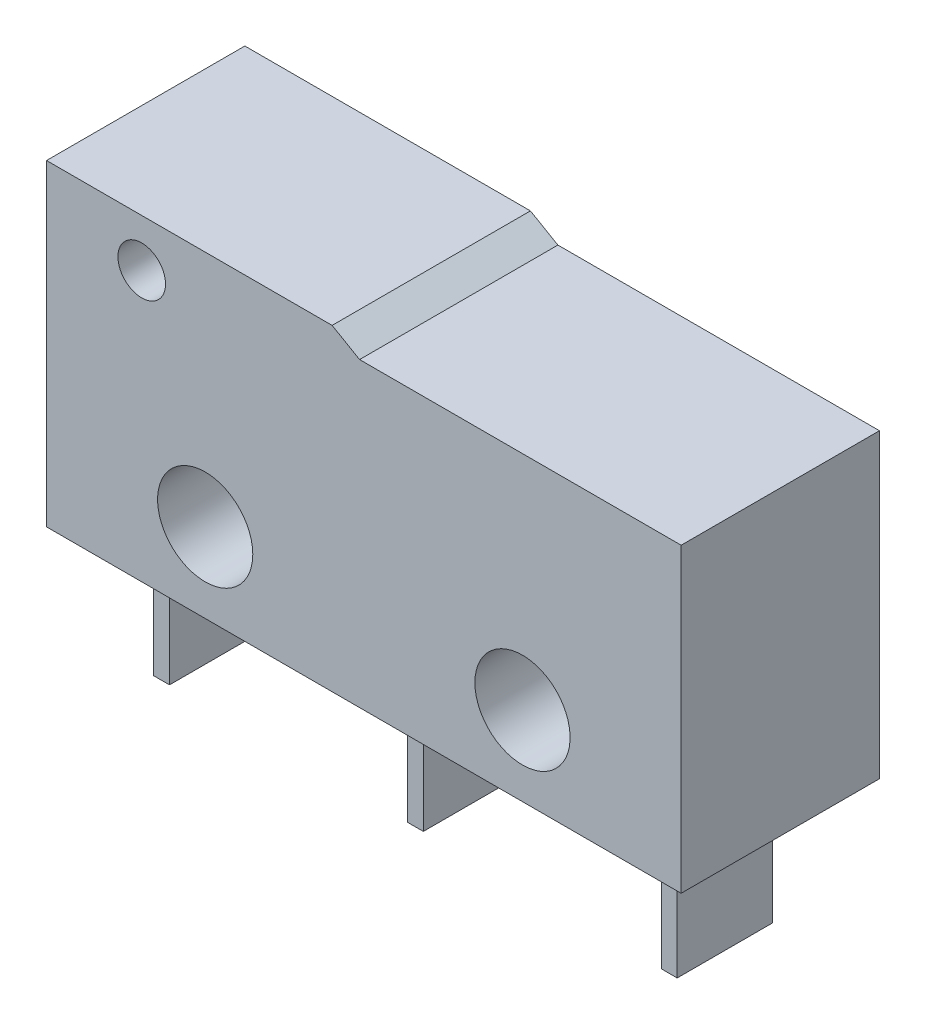
ISO-10303-21;
HEADER;
FILE_DESCRIPTION(('STEP AP214'),'2;1');
FILE_NAME('part.step','',(''),(''),'','','');
FILE_SCHEMA(('AUTOMOTIVE_DESIGN { 1 0 10303 214 1 1 1 1 }'));
ENDSEC;
DATA;
#1=APPLICATION_CONTEXT('core data for automotive mechanical design processes');
#2=APPLICATION_PROTOCOL_DEFINITION('international standard','automotive_design',2000,#1);
#3=PRODUCT_CONTEXT('',#1,'mechanical');
#4=PRODUCT('Part','Part','',(#3));
#5=PRODUCT_RELATED_PRODUCT_CATEGORY('part','',(#4));
#6=PRODUCT_DEFINITION_FORMATION('','',#4);
#7=PRODUCT_DEFINITION_CONTEXT('part definition',#1,'design');
#8=PRODUCT_DEFINITION('design','',#6,#7);
#9=PRODUCT_DEFINITION_SHAPE('','',#8);
#10=(LENGTH_UNIT() NAMED_UNIT(*) SI_UNIT(.MILLI.,.METRE.));
#11=(NAMED_UNIT(*) PLANE_ANGLE_UNIT() SI_UNIT($,.RADIAN.));
#12=(NAMED_UNIT(*) SI_UNIT($,.STERADIAN.) SOLID_ANGLE_UNIT());
#13=UNCERTAINTY_MEASURE_WITH_UNIT(LENGTH_MEASURE(1.E-05),#10,'distance_accuracy_value','');
#14=(GEOMETRIC_REPRESENTATION_CONTEXT(3) GLOBAL_UNCERTAINTY_ASSIGNED_CONTEXT((#13)) GLOBAL_UNIT_ASSIGNED_CONTEXT((#10,
#11,#12)) REPRESENTATION_CONTEXT('',''));
#15=CARTESIAN_POINT('',(0.,0.,0.));
#16=DIRECTION('',(0.,0.,1.));
#17=DIRECTION('',(1.,0.,0.));
#18=AXIS2_PLACEMENT_3D('',#15,#16,#17);
#19=CARTESIAN_POINT('',(10.,0.,3.125));
#20=DIRECTION('',(0.,1.,0.));
#21=DIRECTION('',(0.,0.,1.));
#22=AXIS2_PLACEMENT_3D('',#19,#20,#21);
#23=PLANE('',#22);
#24=DIRECTION('',(0.,0.,-1.));
#25=VECTOR('',#24,1.);
#26=CARTESIAN_POINT('',(-8.25,0.,-1.5));
#27=LINE('',#26,#25);
#28=CARTESIAN_POINT('',(-8.25,0.,1.5));
#29=VERTEX_POINT('',#28);
#30=CARTESIAN_POINT('',(-8.25,0.,-1.5));
#31=VERTEX_POINT('',#30);
#32=EDGE_CURVE('E179',#29,#31,#27,.T.);
#33=ORIENTED_EDGE('',*,*,#32,.F.);
#34=DIRECTION('',(-1.,0.,0.));
#35=VECTOR('',#34,1.);
#36=CARTESIAN_POINT('',(-7.75,0.,1.5));
#37=LINE('',#36,#35);
#38=CARTESIAN_POINT('',(-7.75,0.,1.5));
#39=VERTEX_POINT('',#38);
#40=EDGE_CURVE('E192',#39,#29,#37,.T.);
#41=ORIENTED_EDGE('',*,*,#40,.F.);
#42=DIRECTION('',(0.,0.,1.));
#43=VECTOR('',#42,1.);
#44=CARTESIAN_POINT('',(-7.75,0.,-1.5));
#45=LINE('',#44,#43);
#46=CARTESIAN_POINT('',(-7.75,0.,-1.5));
#47=VERTEX_POINT('',#46);
#48=EDGE_CURVE('E201',#47,#39,#45,.T.);
#49=ORIENTED_EDGE('',*,*,#48,.F.);
#50=DIRECTION('',(1.,0.,0.));
#51=VECTOR('',#50,1.);
#52=CARTESIAN_POINT('',(-7.75,0.,-1.5));
#53=LINE('',#52,#51);
#54=EDGE_CURVE('E182',#31,#47,#53,.T.);
#55=ORIENTED_EDGE('',*,*,#54,.F.);
#56=EDGE_LOOP('',(#33,#41,#49,#55));
#57=FACE_BOUND('',#56,.T.);
#58=DIRECTION('',(1.,0.,0.));
#59=VECTOR('',#58,1.);
#60=CARTESIAN_POINT('',(10.,0.,-3.125));
#61=LINE('',#60,#59);
#62=CARTESIAN_POINT('',(-10.,0.,-3.125));
#63=VERTEX_POINT('',#62);
#64=CARTESIAN_POINT('',(10.,0.,-3.125));
#65=VERTEX_POINT('',#64);
#66=EDGE_CURVE('E288',#63,#65,#61,.T.);
#67=ORIENTED_EDGE('',*,*,#66,.T.);
#68=DIRECTION('',(0.,0.,-1.));
#69=VECTOR('',#68,1.);
#70=CARTESIAN_POINT('',(10.,0.,3.125));
#71=LINE('',#70,#69);
#72=CARTESIAN_POINT('',(10.,0.,3.125));
#73=VERTEX_POINT('',#72);
#74=EDGE_CURVE('E303',#73,#65,#71,.T.);
#75=ORIENTED_EDGE('',*,*,#74,.F.);
#76=DIRECTION('',(1.,0.,0.));
#77=VECTOR('',#76,1.);
#78=CARTESIAN_POINT('',(10.,0.,3.125));
#79=LINE('',#78,#77);
#80=CARTESIAN_POINT('',(-10.,0.,3.125));
#81=VERTEX_POINT('',#80);
#82=EDGE_CURVE('E275',#81,#73,#79,.T.);
#83=ORIENTED_EDGE('',*,*,#82,.F.);
#84=DIRECTION('',(0.,0.,-1.));
#85=VECTOR('',#84,1.);
#86=CARTESIAN_POINT('',(-10.,0.,3.125));
#87=LINE('',#86,#85);
#88=EDGE_CURVE('E41',#81,#63,#87,.T.);
#89=ORIENTED_EDGE('',*,*,#88,.T.);
#90=EDGE_LOOP('',(#67,#75,#83,#89));
#91=FACE_BOUND('',#90,.T.);
#92=DIRECTION('',(0.,0.,-1.));
#93=VECTOR('',#92,1.);
#94=CARTESIAN_POINT('',(-0.25,0.,-1.5));
#95=LINE('',#94,#93);
#96=CARTESIAN_POINT('',(-0.25,0.,1.5));
#97=VERTEX_POINT('',#96);
#98=CARTESIAN_POINT('',(-0.25,0.,-1.5));
#99=VERTEX_POINT('',#98);
#100=EDGE_CURVE('E217',#97,#99,#95,.T.);
#101=ORIENTED_EDGE('',*,*,#100,.F.);
#102=DIRECTION('',(-1.,0.,0.));
#103=VECTOR('',#102,1.);
#104=CARTESIAN_POINT('',(0.25,0.,1.5));
#105=LINE('',#104,#103);
#106=CARTESIAN_POINT('',(0.25,0.,1.5));
#107=VERTEX_POINT('',#106);
#108=EDGE_CURVE('E222',#107,#97,#105,.T.);
#109=ORIENTED_EDGE('',*,*,#108,.F.);
#110=DIRECTION('',(0.,0.,1.));
#111=VECTOR('',#110,1.);
#112=CARTESIAN_POINT('',(0.25,0.,-1.5));
#113=LINE('',#112,#111);
#114=CARTESIAN_POINT('',(0.25,0.,-1.5));
#115=VERTEX_POINT('',#114);
#116=EDGE_CURVE('E234',#115,#107,#113,.T.);
#117=ORIENTED_EDGE('',*,*,#116,.F.);
#118=DIRECTION('',(1.,0.,0.));
#119=VECTOR('',#118,1.);
#120=CARTESIAN_POINT('',(0.25,0.,-1.5));
#121=LINE('',#120,#119);
#122=EDGE_CURVE('E231',#99,#115,#121,.T.);
#123=ORIENTED_EDGE('',*,*,#122,.F.);
#124=EDGE_LOOP('',(#101,#109,#117,#123));
#125=FACE_BOUND('',#124,.T.);
#126=DIRECTION('',(0.,0.,-1.));
#127=VECTOR('',#126,1.);
#128=CARTESIAN_POINT('',(7.75,0.,-1.5));
#129=LINE('',#128,#127);
#130=CARTESIAN_POINT('',(7.75,0.,1.5));
#131=VERTEX_POINT('',#130);
#132=CARTESIAN_POINT('',(7.75,0.,-1.5));
#133=VERTEX_POINT('',#132);
#134=EDGE_CURVE('E178',#131,#133,#129,.T.);
#135=ORIENTED_EDGE('',*,*,#134,.F.);
#136=DIRECTION('',(-1.,0.,0.));
#137=VECTOR('',#136,1.);
#138=CARTESIAN_POINT('',(7.75,0.,1.5));
#139=LINE('',#138,#137);
#140=CARTESIAN_POINT('',(8.25,0.,1.5));
#141=VERTEX_POINT('',#140);
#142=EDGE_CURVE('E175',#141,#131,#139,.T.);
#143=ORIENTED_EDGE('',*,*,#142,.F.);
#144=DIRECTION('',(0.,0.,1.));
#145=VECTOR('',#144,1.);
#146=CARTESIAN_POINT('',(8.25,0.,-1.5));
#147=LINE('',#146,#145);
#148=CARTESIAN_POINT('',(8.25,0.,-1.5));
#149=VERTEX_POINT('',#148);
#150=EDGE_CURVE('E53',#149,#141,#147,.T.);
#151=ORIENTED_EDGE('',*,*,#150,.F.);
#152=DIRECTION('',(1.,0.,0.));
#153=VECTOR('',#152,1.);
#154=CARTESIAN_POINT('',(7.75,0.,-1.5));
#155=LINE('',#154,#153);
#156=EDGE_CURVE('E48',#133,#149,#155,.T.);
#157=ORIENTED_EDGE('',*,*,#156,.F.);
#158=EDGE_LOOP('',(#135,#143,#151,#157));
#159=FACE_BOUND('',#158,.T.);
#160=ADVANCED_FACE('F33',(#57,#91,#125,#159),#23,.F.);
#161=CARTESIAN_POINT('',(0.,0.,3.125));
#162=DIRECTION('',(0.,0.,-1.));
#163=DIRECTION('',(-1.,0.,0.));
#164=AXIS2_PLACEMENT_3D('',#161,#162,#163);
#165=PLANE('',#164);
#166=DIRECTION('',(-1.,0.,0.));
#167=VECTOR('',#166,1.);
#168=CARTESIAN_POINT('',(-10.,10.,3.125));
#169=LINE('',#168,#167);
#170=CARTESIAN_POINT('',(-1.,10.,3.125));
#171=VERTEX_POINT('',#170);
#172=CARTESIAN_POINT('',(-10.,10.,3.125));
#173=VERTEX_POINT('',#172);
#174=EDGE_CURVE('E269',#171,#173,#169,.T.);
#175=ORIENTED_EDGE('',*,*,#174,.T.);
#176=DIRECTION('',(0.,-1.,0.));
#177=VECTOR('',#176,1.);
#178=CARTESIAN_POINT('',(-10.,0.,3.125));
#179=LINE('',#178,#177);
#180=EDGE_CURVE('E272',#173,#81,#179,.T.);
#181=ORIENTED_EDGE('',*,*,#180,.T.);
#182=ORIENTED_EDGE('',*,*,#82,.T.);
#183=DIRECTION('',(0.,1.,0.));
#184=VECTOR('',#183,1.);
#185=CARTESIAN_POINT('',(10.,9.5,3.125));
#186=LINE('',#185,#184);
#187=CARTESIAN_POINT('',(10.,9.5,3.125));
#188=VERTEX_POINT('',#187);
#189=EDGE_CURVE('E277',#73,#188,#186,.T.);
#190=ORIENTED_EDGE('',*,*,#189,.T.);
#191=DIRECTION('',(-1.,0.,0.));
#192=VECTOR('',#191,1.);
#193=CARTESIAN_POINT('',(-0.133974596215564,9.5,3.125));
#194=LINE('',#193,#192);
#195=CARTESIAN_POINT('',(-0.133974596215564,9.5,3.125));
#196=VERTEX_POINT('',#195);
#197=EDGE_CURVE('E279',#188,#196,#194,.T.);
#198=ORIENTED_EDGE('',*,*,#197,.T.);
#199=DIRECTION('',(-0.866025403784438,0.500000000000001,0.));
#200=VECTOR('',#199,1.);
#201=CARTESIAN_POINT('',(-1.,10.,3.125));
#202=LINE('',#201,#200);
#203=EDGE_CURVE('E281',#196,#171,#202,.T.);
#204=ORIENTED_EDGE('',*,*,#203,.T.);
#205=EDGE_LOOP('',(#175,#181,#182,#190,#198,#204));
#206=FACE_BOUND('',#205,.T.);
#207=CARTESIAN_POINT('',(-5.,2.5,3.125));
#208=DIRECTION('',(0.,0.,1.));
#209=DIRECTION('',(1.,0.,0.));
#210=AXIS2_PLACEMENT_3D('',#207,#208,#209);
#211=CIRCLE('',#210,1.5);
#212=CARTESIAN_POINT('',(-3.5,2.5,3.125));
#213=VERTEX_POINT('',#212);
#214=EDGE_CURVE('E263',#213,#213,#211,.T.);
#215=ORIENTED_EDGE('',*,*,#214,.F.);
#216=EDGE_LOOP('',(#215));
#217=FACE_BOUND('',#216,.T.);
#218=CARTESIAN_POINT('',(5.,2.5,3.125));
#219=DIRECTION('',(0.,0.,1.));
#220=DIRECTION('',(-1.,0.,0.));
#221=AXIS2_PLACEMENT_3D('',#218,#219,#220);
#222=CIRCLE('',#221,1.5);
#223=CARTESIAN_POINT('',(3.5,2.5,3.125));
#224=VERTEX_POINT('',#223);
#225=EDGE_CURVE('E257',#224,#224,#222,.T.);
#226=ORIENTED_EDGE('',*,*,#225,.F.);
#227=EDGE_LOOP('',(#226));
#228=FACE_BOUND('',#227,.T.);
#229=CARTESIAN_POINT('',(-7.,8.5,3.125));
#230=DIRECTION('',(0.,0.,1.));
#231=DIRECTION('',(1.,0.,0.));
#232=AXIS2_PLACEMENT_3D('',#229,#230,#231);
#233=CIRCLE('',#232,0.75);
#234=CARTESIAN_POINT('',(-6.25,8.5,3.125));
#235=VERTEX_POINT('',#234);
#236=EDGE_CURVE('E251',#235,#235,#233,.T.);
#237=ORIENTED_EDGE('',*,*,#236,.F.);
#238=EDGE_LOOP('',(#237));
#239=FACE_BOUND('',#238,.T.);
#240=ADVANCED_FACE('F330',(#206,#217,#228,#239),#165,.F.);
#241=CARTESIAN_POINT('',(0.,0.,-3.125));
#242=DIRECTION('',(0.,0.,-1.));
#243=DIRECTION('',(-1.,0.,0.));
#244=AXIS2_PLACEMENT_3D('',#241,#242,#243);
#245=PLANE('',#244);
#246=CARTESIAN_POINT('',(5.,2.5,-3.125));
#247=DIRECTION('',(0.,0.,1.));
#248=DIRECTION('',(-1.,0.,0.));
#249=AXIS2_PLACEMENT_3D('',#246,#247,#248);
#250=CIRCLE('',#249,1.5);
#251=CARTESIAN_POINT('',(3.5,2.5,-3.125));
#252=VERTEX_POINT('',#251);
#253=EDGE_CURVE('E254',#252,#252,#250,.T.);
#254=ORIENTED_EDGE('',*,*,#253,.T.);
#255=EDGE_LOOP('',(#254));
#256=FACE_BOUND('',#255,.T.);
#257=DIRECTION('',(-1.,0.,0.));
#258=VECTOR('',#257,1.);
#259=CARTESIAN_POINT('',(-10.,10.,-3.125));
#260=LINE('',#259,#258);
#261=CARTESIAN_POINT('',(-1.,10.,-3.125));
#262=VERTEX_POINT('',#261);
#263=CARTESIAN_POINT('',(-10.,10.,-3.125));
#264=VERTEX_POINT('',#263);
#265=EDGE_CURVE('E266',#262,#264,#260,.T.);
#266=ORIENTED_EDGE('',*,*,#265,.F.);
#267=DIRECTION('',(-0.866025403784438,0.500000000000001,0.));
#268=VECTOR('',#267,1.);
#269=CARTESIAN_POINT('',(-1.,10.,-3.125));
#270=LINE('',#269,#268);
#271=CARTESIAN_POINT('',(-0.133974596215564,9.5,-3.125));
#272=VERTEX_POINT('',#271);
#273=EDGE_CURVE('E273',#272,#262,#270,.T.);
#274=ORIENTED_EDGE('',*,*,#273,.F.);
#275=DIRECTION('',(-1.,0.,0.));
#276=VECTOR('',#275,1.);
#277=CARTESIAN_POINT('',(-0.133974596215564,9.5,-3.125));
#278=LINE('',#277,#276);
#279=CARTESIAN_POINT('',(10.,9.5,-3.125));
#280=VERTEX_POINT('',#279);
#281=EDGE_CURVE('E292',#280,#272,#278,.T.);
#282=ORIENTED_EDGE('',*,*,#281,.F.);
#283=DIRECTION('',(0.,1.,0.));
#284=VECTOR('',#283,1.);
#285=CARTESIAN_POINT('',(10.,9.5,-3.125));
#286=LINE('',#285,#284);
#287=EDGE_CURVE('E290',#65,#280,#286,.T.);
#288=ORIENTED_EDGE('',*,*,#287,.F.);
#289=ORIENTED_EDGE('',*,*,#66,.F.);
#290=DIRECTION('',(0.,-1.,0.));
#291=VECTOR('',#290,1.);
#292=CARTESIAN_POINT('',(-10.,0.,-3.125));
#293=LINE('',#292,#291);
#294=EDGE_CURVE('E286',#264,#63,#293,.T.);
#295=ORIENTED_EDGE('',*,*,#294,.F.);
#296=EDGE_LOOP('',(#266,#274,#282,#288,#289,#295));
#297=FACE_BOUND('',#296,.T.);
#298=CARTESIAN_POINT('',(-5.,2.5,-3.125));
#299=DIRECTION('',(0.,0.,1.));
#300=DIRECTION('',(1.,0.,0.));
#301=AXIS2_PLACEMENT_3D('',#298,#299,#300);
#302=CIRCLE('',#301,1.5);
#303=CARTESIAN_POINT('',(-3.5,2.5,-3.125));
#304=VERTEX_POINT('',#303);
#305=EDGE_CURVE('E260',#304,#304,#302,.T.);
#306=ORIENTED_EDGE('',*,*,#305,.T.);
#307=EDGE_LOOP('',(#306));
#308=FACE_BOUND('',#307,.T.);
#309=CARTESIAN_POINT('',(-7.,8.5,-3.125));
#310=DIRECTION('',(0.,0.,1.));
#311=DIRECTION('',(1.,0.,0.));
#312=AXIS2_PLACEMENT_3D('',#309,#310,#311);
#313=CIRCLE('',#312,0.75);
#314=CARTESIAN_POINT('',(-6.25,8.5,-3.125));
#315=VERTEX_POINT('',#314);
#316=EDGE_CURVE('E250',#315,#315,#313,.T.);
#317=ORIENTED_EDGE('',*,*,#316,.T.);
#318=EDGE_LOOP('',(#317));
#319=FACE_BOUND('',#318,.T.);
#320=ADVANCED_FACE('F316',(#256,#297,#308,#319),#245,.T.);
#321=CARTESIAN_POINT('',(-10.,10.,3.125));
#322=DIRECTION('',(0.,-1.,0.));
#323=DIRECTION('',(0.,0.,-1.));
#324=AXIS2_PLACEMENT_3D('',#321,#322,#323);
#325=PLANE('',#324);
#326=ORIENTED_EDGE('',*,*,#265,.T.);
#327=DIRECTION('',(0.,0.,-1.));
#328=VECTOR('',#327,1.);
#329=CARTESIAN_POINT('',(-10.,10.,3.125));
#330=LINE('',#329,#328);
#331=EDGE_CURVE('E11',#173,#264,#330,.T.);
#332=ORIENTED_EDGE('',*,*,#331,.F.);
#333=ORIENTED_EDGE('',*,*,#174,.F.);
#334=DIRECTION('',(0.,0.,-1.));
#335=VECTOR('',#334,1.);
#336=CARTESIAN_POINT('',(-1.,10.,3.125));
#337=LINE('',#336,#335);
#338=EDGE_CURVE('E283',#171,#262,#337,.T.);
#339=ORIENTED_EDGE('',*,*,#338,.T.);
#340=EDGE_LOOP('',(#326,#332,#333,#339));
#341=FACE_BOUND('',#340,.T.);
#342=ADVANCED_FACE('F35',(#341),#325,.F.);
#343=CARTESIAN_POINT('',(-10.,0.,3.125));
#344=DIRECTION('',(1.,0.,0.));
#345=DIRECTION('',(0.,0.,-1.));
#346=AXIS2_PLACEMENT_3D('',#343,#344,#345);
#347=PLANE('',#346);
#348=ORIENTED_EDGE('',*,*,#294,.T.);
#349=ORIENTED_EDGE('',*,*,#88,.F.);
#350=ORIENTED_EDGE('',*,*,#180,.F.);
#351=ORIENTED_EDGE('',*,*,#331,.T.);
#352=EDGE_LOOP('',(#348,#349,#350,#351));
#353=FACE_BOUND('',#352,.T.);
#354=ADVANCED_FACE('F335',(#353),#347,.F.);
#355=CARTESIAN_POINT('',(10.,9.5,3.125));
#356=DIRECTION('',(-1.,0.,0.));
#357=DIRECTION('',(0.,0.,1.));
#358=AXIS2_PLACEMENT_3D('',#355,#356,#357);
#359=PLANE('',#358);
#360=ORIENTED_EDGE('',*,*,#287,.T.);
#361=DIRECTION('',(0.,0.,-1.));
#362=VECTOR('',#361,1.);
#363=CARTESIAN_POINT('',(10.,9.5,3.125));
#364=LINE('',#363,#362);
#365=EDGE_CURVE('E300',#188,#280,#364,.T.);
#366=ORIENTED_EDGE('',*,*,#365,.F.);
#367=ORIENTED_EDGE('',*,*,#189,.F.);
#368=ORIENTED_EDGE('',*,*,#74,.T.);
#369=EDGE_LOOP('',(#360,#366,#367,#368));
#370=FACE_BOUND('',#369,.T.);
#371=ADVANCED_FACE('F322',(#370),#359,.F.);
#372=CARTESIAN_POINT('',(-0.133974596215564,9.5,3.125));
#373=DIRECTION('',(0.,-1.,0.));
#374=DIRECTION('',(0.,0.,-1.));
#375=AXIS2_PLACEMENT_3D('',#372,#373,#374);
#376=PLANE('',#375);
#377=ORIENTED_EDGE('',*,*,#281,.T.);
#378=DIRECTION('',(0.,0.,-1.));
#379=VECTOR('',#378,1.);
#380=CARTESIAN_POINT('',(-0.133974596215564,9.5,3.125));
#381=LINE('',#380,#379);
#382=EDGE_CURVE('E297',#196,#272,#381,.T.);
#383=ORIENTED_EDGE('',*,*,#382,.F.);
#384=ORIENTED_EDGE('',*,*,#197,.F.);
#385=ORIENTED_EDGE('',*,*,#365,.T.);
#386=EDGE_LOOP('',(#377,#383,#384,#385));
#387=FACE_BOUND('',#386,.T.);
#388=ADVANCED_FACE('F326',(#387),#376,.F.);
#389=CARTESIAN_POINT('',(-1.,10.,3.125));
#390=DIRECTION('',(-0.500000000000001,-0.866025403784438,0.));
#391=DIRECTION('',(0.866025403784438,-0.500000000000001,0.));
#392=AXIS2_PLACEMENT_3D('',#389,#390,#391);
#393=PLANE('',#392);
#394=ORIENTED_EDGE('',*,*,#273,.T.);
#395=ORIENTED_EDGE('',*,*,#338,.F.);
#396=ORIENTED_EDGE('',*,*,#203,.F.);
#397=ORIENTED_EDGE('',*,*,#382,.T.);
#398=EDGE_LOOP('',(#394,#395,#396,#397));
#399=FACE_BOUND('',#398,.T.);
#400=ADVANCED_FACE('F338',(#399),#393,.F.);
#401=CARTESIAN_POINT('',(-5.,2.5,3.125));
#402=DIRECTION('',(0.,0.,-1.));
#403=DIRECTION('',(-1.,0.,0.));
#404=AXIS2_PLACEMENT_3D('',#401,#402,#403);
#405=CYLINDRICAL_SURFACE('',#404,1.5);
#406=ORIENTED_EDGE('',*,*,#214,.T.);
#407=EDGE_LOOP('',(#406));
#408=FACE_BOUND('',#407,.T.);
#409=ORIENTED_EDGE('',*,*,#305,.F.);
#410=EDGE_LOOP('',(#409));
#411=FACE_BOUND('',#410,.T.);
#412=ADVANCED_FACE('F340',(#408,#411),#405,.F.);
#413=CARTESIAN_POINT('',(5.,2.5,3.125));
#414=DIRECTION('',(0.,0.,-1.));
#415=DIRECTION('',(-1.,0.,0.));
#416=AXIS2_PLACEMENT_3D('',#413,#414,#415);
#417=CYLINDRICAL_SURFACE('',#416,1.5);
#418=ORIENTED_EDGE('',*,*,#225,.T.);
#419=EDGE_LOOP('',(#418));
#420=FACE_BOUND('',#419,.T.);
#421=ORIENTED_EDGE('',*,*,#253,.F.);
#422=EDGE_LOOP('',(#421));
#423=FACE_BOUND('',#422,.T.);
#424=ADVANCED_FACE('F346',(#420,#423),#417,.F.);
#425=CARTESIAN_POINT('',(-7.,8.5,3.125));
#426=DIRECTION('',(0.,0.,-1.));
#427=DIRECTION('',(-1.,0.,0.));
#428=AXIS2_PLACEMENT_3D('',#425,#426,#427);
#429=CYLINDRICAL_SURFACE('',#428,0.75);
#430=ORIENTED_EDGE('',*,*,#236,.T.);
#431=EDGE_LOOP('',(#430));
#432=FACE_BOUND('',#431,.T.);
#433=ORIENTED_EDGE('',*,*,#316,.F.);
#434=EDGE_LOOP('',(#433));
#435=FACE_BOUND('',#434,.T.);
#436=ADVANCED_FACE('F373',(#432,#435),#429,.F.);
#437=CARTESIAN_POINT('',(-0.25,-4.,-1.5));
#438=DIRECTION('',(1.,0.,0.));
#439=DIRECTION('',(0.,0.,-1.));
#440=AXIS2_PLACEMENT_3D('',#437,#438,#439);
#441=PLANE('',#440);
#442=ORIENTED_EDGE('',*,*,#100,.T.);
#443=DIRECTION('',(0.,1.,0.));
#444=VECTOR('',#443,1.);
#445=CARTESIAN_POINT('',(-0.25,-4.,-1.5));
#446=LINE('',#445,#444);
#447=CARTESIAN_POINT('',(-0.25,-4.,-1.5));
#448=VERTEX_POINT('',#447);
#449=EDGE_CURVE('E247',#448,#99,#446,.T.);
#450=ORIENTED_EDGE('',*,*,#449,.F.);
#451=DIRECTION('',(0.,0.,-1.));
#452=VECTOR('',#451,1.);
#453=CARTESIAN_POINT('',(-0.25,-4.,-1.5));
#454=LINE('',#453,#452);
#455=CARTESIAN_POINT('',(-0.25,-4.,1.5));
#456=VERTEX_POINT('',#455);
#457=EDGE_CURVE('E218',#456,#448,#454,.T.);
#458=ORIENTED_EDGE('',*,*,#457,.F.);
#459=DIRECTION('',(0.,1.,0.));
#460=VECTOR('',#459,1.);
#461=CARTESIAN_POINT('',(-0.25,-4.,1.5));
#462=LINE('',#461,#460);
#463=EDGE_CURVE('E228',#456,#97,#462,.T.);
#464=ORIENTED_EDGE('',*,*,#463,.T.);
#465=EDGE_LOOP('',(#442,#450,#458,#464));
#466=FACE_BOUND('',#465,.T.);
#467=ADVANCED_FACE('F377',(#466),#441,.F.);
#468=CARTESIAN_POINT('',(0.25,-4.,-1.5));
#469=DIRECTION('',(0.,0.,1.));
#470=DIRECTION('',(1.,0.,0.));
#471=AXIS2_PLACEMENT_3D('',#468,#469,#470);
#472=PLANE('',#471);
#473=ORIENTED_EDGE('',*,*,#122,.T.);
#474=DIRECTION('',(0.,1.,0.));
#475=VECTOR('',#474,1.);
#476=CARTESIAN_POINT('',(0.25,-4.,-1.5));
#477=LINE('',#476,#475);
#478=CARTESIAN_POINT('',(0.25,-4.,-1.5));
#479=VERTEX_POINT('',#478);
#480=EDGE_CURVE('E244',#479,#115,#477,.T.);
#481=ORIENTED_EDGE('',*,*,#480,.F.);
#482=DIRECTION('',(1.,0.,0.));
#483=VECTOR('',#482,1.);
#484=CARTESIAN_POINT('',(0.25,-4.,-1.5));
#485=LINE('',#484,#483);
#486=EDGE_CURVE('E221',#448,#479,#485,.T.);
#487=ORIENTED_EDGE('',*,*,#486,.F.);
#488=ORIENTED_EDGE('',*,*,#449,.T.);
#489=EDGE_LOOP('',(#473,#481,#487,#488));
#490=FACE_BOUND('',#489,.T.);
#491=ADVANCED_FACE('F381',(#490),#472,.F.);
#492=CARTESIAN_POINT('',(0.25,-4.,-1.5));
#493=DIRECTION('',(-1.,0.,0.));
#494=DIRECTION('',(0.,0.,1.));
#495=AXIS2_PLACEMENT_3D('',#492,#493,#494);
#496=PLANE('',#495);
#497=ORIENTED_EDGE('',*,*,#116,.T.);
#498=DIRECTION('',(0.,1.,0.));
#499=VECTOR('',#498,1.);
#500=CARTESIAN_POINT('',(0.25,-4.,1.5));
#501=LINE('',#500,#499);
#502=CARTESIAN_POINT('',(0.25,-4.,1.5));
#503=VERTEX_POINT('',#502);
#504=EDGE_CURVE('E241',#503,#107,#501,.T.);
#505=ORIENTED_EDGE('',*,*,#504,.F.);
#506=DIRECTION('',(0.,0.,1.));
#507=VECTOR('',#506,1.);
#508=CARTESIAN_POINT('',(0.25,-4.,-1.5));
#509=LINE('',#508,#507);
#510=EDGE_CURVE('E224',#479,#503,#509,.T.);
#511=ORIENTED_EDGE('',*,*,#510,.F.);
#512=ORIENTED_EDGE('',*,*,#480,.T.);
#513=EDGE_LOOP('',(#497,#505,#511,#512));
#514=FACE_BOUND('',#513,.T.);
#515=ADVANCED_FACE('F385',(#514),#496,.F.);
#516=CARTESIAN_POINT('',(0.25,-4.,1.5));
#517=DIRECTION('',(0.,0.,-1.));
#518=DIRECTION('',(-1.,0.,0.));
#519=AXIS2_PLACEMENT_3D('',#516,#517,#518);
#520=PLANE('',#519);
#521=ORIENTED_EDGE('',*,*,#108,.T.);
#522=ORIENTED_EDGE('',*,*,#463,.F.);
#523=DIRECTION('',(-1.,0.,0.));
#524=VECTOR('',#523,1.);
#525=CARTESIAN_POINT('',(0.25,-4.,1.5));
#526=LINE('',#525,#524);
#527=EDGE_CURVE('E226',#503,#456,#526,.T.);
#528=ORIENTED_EDGE('',*,*,#527,.F.);
#529=ORIENTED_EDGE('',*,*,#504,.T.);
#530=EDGE_LOOP('',(#521,#522,#528,#529));
#531=FACE_BOUND('',#530,.T.);
#532=ADVANCED_FACE('F389',(#531),#520,.F.);
#533=CARTESIAN_POINT('',(0.,-4.,0.));
#534=DIRECTION('',(0.,-1.,0.));
#535=DIRECTION('',(0.,0.,-1.));
#536=AXIS2_PLACEMENT_3D('',#533,#534,#535);
#537=PLANE('',#536);
#538=ORIENTED_EDGE('',*,*,#457,.T.);
#539=ORIENTED_EDGE('',*,*,#486,.T.);
#540=ORIENTED_EDGE('',*,*,#510,.T.);
#541=ORIENTED_EDGE('',*,*,#527,.T.);
#542=EDGE_LOOP('',(#538,#539,#540,#541));
#543=FACE_BOUND('',#542,.T.);
#544=ADVANCED_FACE('F393',(#543),#537,.T.);
#545=CARTESIAN_POINT('',(-8.25,-4.,-1.5));
#546=DIRECTION('',(1.,0.,0.));
#547=DIRECTION('',(0.,0.,-1.));
#548=AXIS2_PLACEMENT_3D('',#545,#546,#547);
#549=PLANE('',#548);
#550=ORIENTED_EDGE('',*,*,#32,.T.);
#551=DIRECTION('',(0.,1.,0.));
#552=VECTOR('',#551,1.);
#553=CARTESIAN_POINT('',(-8.25,-4.,-1.5));
#554=LINE('',#553,#552);
#555=CARTESIAN_POINT('',(-8.25,-4.,-1.5));
#556=VERTEX_POINT('',#555);
#557=EDGE_CURVE('E214',#556,#31,#554,.T.);
#558=ORIENTED_EDGE('',*,*,#557,.F.);
#559=DIRECTION('',(0.,0.,-1.));
#560=VECTOR('',#559,1.);
#561=CARTESIAN_POINT('',(-8.25,-4.,-1.5));
#562=LINE('',#561,#560);
#563=CARTESIAN_POINT('',(-8.25,-4.,1.5));
#564=VERTEX_POINT('',#563);
#565=EDGE_CURVE('E188',#564,#556,#562,.T.);
#566=ORIENTED_EDGE('',*,*,#565,.F.);
#567=DIRECTION('',(0.,1.,0.));
#568=VECTOR('',#567,1.);
#569=CARTESIAN_POINT('',(-8.25,-4.,1.5));
#570=LINE('',#569,#568);
#571=EDGE_CURVE('E197',#564,#29,#570,.T.);
#572=ORIENTED_EDGE('',*,*,#571,.T.);
#573=EDGE_LOOP('',(#550,#558,#566,#572));
#574=FACE_BOUND('',#573,.T.);
#575=ADVANCED_FACE('F397',(#574),#549,.F.);
#576=CARTESIAN_POINT('',(-7.75,-4.,-1.5));
#577=DIRECTION('',(0.,0.,1.));
#578=DIRECTION('',(1.,0.,0.));
#579=AXIS2_PLACEMENT_3D('',#576,#577,#578);
#580=PLANE('',#579);
#581=ORIENTED_EDGE('',*,*,#54,.T.);
#582=DIRECTION('',(0.,1.,0.));
#583=VECTOR('',#582,1.);
#584=CARTESIAN_POINT('',(-7.75,-4.,-1.5));
#585=LINE('',#584,#583);
#586=CARTESIAN_POINT('',(-7.75,-4.,-1.5));
#587=VERTEX_POINT('',#586);
#588=EDGE_CURVE('E211',#587,#47,#585,.T.);
#589=ORIENTED_EDGE('',*,*,#588,.F.);
#590=DIRECTION('',(1.,0.,0.));
#591=VECTOR('',#590,1.);
#592=CARTESIAN_POINT('',(-7.75,-4.,-1.5));
#593=LINE('',#592,#591);
#594=EDGE_CURVE('E191',#556,#587,#593,.T.);
#595=ORIENTED_EDGE('',*,*,#594,.F.);
#596=ORIENTED_EDGE('',*,*,#557,.T.);
#597=EDGE_LOOP('',(#581,#589,#595,#596));
#598=FACE_BOUND('',#597,.T.);
#599=ADVANCED_FACE('F401',(#598),#580,.F.);
#600=CARTESIAN_POINT('',(-7.75,-4.,-1.5));
#601=DIRECTION('',(-1.,0.,0.));
#602=DIRECTION('',(0.,0.,1.));
#603=AXIS2_PLACEMENT_3D('',#600,#601,#602);
#604=PLANE('',#603);
#605=ORIENTED_EDGE('',*,*,#48,.T.);
#606=DIRECTION('',(0.,1.,0.));
#607=VECTOR('',#606,1.);
#608=CARTESIAN_POINT('',(-7.75,-4.,1.5));
#609=LINE('',#608,#607);
#610=CARTESIAN_POINT('',(-7.75,-4.,1.5));
#611=VERTEX_POINT('',#610);
#612=EDGE_CURVE('E208',#611,#39,#609,.T.);
#613=ORIENTED_EDGE('',*,*,#612,.F.);
#614=DIRECTION('',(0.,0.,1.));
#615=VECTOR('',#614,1.);
#616=CARTESIAN_POINT('',(-7.75,-4.,-1.5));
#617=LINE('',#616,#615);
#618=EDGE_CURVE('E194',#587,#611,#617,.T.);
#619=ORIENTED_EDGE('',*,*,#618,.F.);
#620=ORIENTED_EDGE('',*,*,#588,.T.);
#621=EDGE_LOOP('',(#605,#613,#619,#620));
#622=FACE_BOUND('',#621,.T.);
#623=ADVANCED_FACE('F405',(#622),#604,.F.);
#624=CARTESIAN_POINT('',(-7.75,-4.,1.5));
#625=DIRECTION('',(0.,0.,-1.));
#626=DIRECTION('',(-1.,0.,0.));
#627=AXIS2_PLACEMENT_3D('',#624,#625,#626);
#628=PLANE('',#627);
#629=ORIENTED_EDGE('',*,*,#40,.T.);
#630=ORIENTED_EDGE('',*,*,#571,.F.);
#631=DIRECTION('',(-1.,0.,0.));
#632=VECTOR('',#631,1.);
#633=CARTESIAN_POINT('',(-7.75,-4.,1.5));
#634=LINE('',#633,#632);
#635=EDGE_CURVE('E196',#611,#564,#634,.T.);
#636=ORIENTED_EDGE('',*,*,#635,.F.);
#637=ORIENTED_EDGE('',*,*,#612,.T.);
#638=EDGE_LOOP('',(#629,#630,#636,#637));
#639=FACE_BOUND('',#638,.T.);
#640=ADVANCED_FACE('F409',(#639),#628,.F.);
#641=CARTESIAN_POINT('',(0.,-4.,0.));
#642=DIRECTION('',(0.,-1.,0.));
#643=DIRECTION('',(0.,0.,-1.));
#644=AXIS2_PLACEMENT_3D('',#641,#642,#643);
#645=PLANE('',#644);
#646=ORIENTED_EDGE('',*,*,#565,.T.);
#647=ORIENTED_EDGE('',*,*,#594,.T.);
#648=ORIENTED_EDGE('',*,*,#618,.T.);
#649=ORIENTED_EDGE('',*,*,#635,.T.);
#650=EDGE_LOOP('',(#646,#647,#648,#649));
#651=FACE_BOUND('',#650,.T.);
#652=ADVANCED_FACE('F413',(#651),#645,.T.);
#653=CARTESIAN_POINT('',(7.75,-4.,-1.5));
#654=DIRECTION('',(1.,0.,0.));
#655=DIRECTION('',(0.,0.,-1.));
#656=AXIS2_PLACEMENT_3D('',#653,#654,#655);
#657=PLANE('',#656);
#658=ORIENTED_EDGE('',*,*,#134,.T.);
#659=DIRECTION('',(0.,1.,0.));
#660=VECTOR('',#659,1.);
#661=CARTESIAN_POINT('',(7.75,-4.,-1.5));
#662=LINE('',#661,#660);
#663=CARTESIAN_POINT('',(7.75,-4.,-1.5));
#664=VERTEX_POINT('',#663);
#665=EDGE_CURVE('E159',#664,#133,#662,.T.);
#666=ORIENTED_EDGE('',*,*,#665,.F.);
#667=DIRECTION('',(0.,0.,-1.));
#668=VECTOR('',#667,1.);
#669=CARTESIAN_POINT('',(7.75,-4.,-1.5));
#670=LINE('',#669,#668);
#671=CARTESIAN_POINT('',(7.75,-4.,1.5));
#672=VERTEX_POINT('',#671);
#673=EDGE_CURVE('E166',#672,#664,#670,.T.);
#674=ORIENTED_EDGE('',*,*,#673,.F.);
#675=DIRECTION('',(0.,1.,0.));
#676=VECTOR('',#675,1.);
#677=CARTESIAN_POINT('',(7.75,-4.,1.5));
#678=LINE('',#677,#676);
#679=EDGE_CURVE('E579',#672,#131,#678,.T.);
#680=ORIENTED_EDGE('',*,*,#679,.T.);
#681=EDGE_LOOP('',(#658,#666,#674,#680));
#682=FACE_BOUND('',#681,.T.);
#683=ADVANCED_FACE('F177',(#682),#657,.F.);
#684=CARTESIAN_POINT('',(7.75,-4.,-1.5));
#685=DIRECTION('',(0.,0.,1.));
#686=DIRECTION('',(1.,0.,0.));
#687=AXIS2_PLACEMENT_3D('',#684,#685,#686);
#688=PLANE('',#687);
#689=ORIENTED_EDGE('',*,*,#156,.T.);
#690=DIRECTION('',(0.,1.,0.));
#691=VECTOR('',#690,1.);
#692=CARTESIAN_POINT('',(8.25,-4.,-1.5));
#693=LINE('',#692,#691);
#694=CARTESIAN_POINT('',(8.25,-4.,-1.5));
#695=VERTEX_POINT('',#694);
#696=EDGE_CURVE('E162',#695,#149,#693,.T.);
#697=ORIENTED_EDGE('',*,*,#696,.F.);
#698=DIRECTION('',(1.,0.,0.));
#699=VECTOR('',#698,1.);
#700=CARTESIAN_POINT('',(7.75,-4.,-1.5));
#701=LINE('',#700,#699);
#702=EDGE_CURVE('E155',#664,#695,#701,.T.);
#703=ORIENTED_EDGE('',*,*,#702,.F.);
#704=ORIENTED_EDGE('',*,*,#665,.T.);
#705=EDGE_LOOP('',(#689,#697,#703,#704));
#706=FACE_BOUND('',#705,.T.);
#707=ADVANCED_FACE('F157',(#706),#688,.F.);
#708=CARTESIAN_POINT('',(8.25,-4.,-1.5));
#709=DIRECTION('',(-1.,0.,0.));
#710=DIRECTION('',(0.,0.,1.));
#711=AXIS2_PLACEMENT_3D('',#708,#709,#710);
#712=PLANE('',#711);
#713=ORIENTED_EDGE('',*,*,#150,.T.);
#714=DIRECTION('',(0.,1.,0.));
#715=VECTOR('',#714,1.);
#716=CARTESIAN_POINT('',(8.25,-4.,1.5));
#717=LINE('',#716,#715);
#718=CARTESIAN_POINT('',(8.25,-4.,1.5));
#719=VERTEX_POINT('',#718);
#720=EDGE_CURVE('E184',#719,#141,#717,.T.);
#721=ORIENTED_EDGE('',*,*,#720,.F.);
#722=DIRECTION('',(0.,0.,1.));
#723=VECTOR('',#722,1.);
#724=CARTESIAN_POINT('',(8.25,-4.,-1.5));
#725=LINE('',#724,#723);
#726=EDGE_CURVE('E165',#695,#719,#725,.T.);
#727=ORIENTED_EDGE('',*,*,#726,.F.);
#728=ORIENTED_EDGE('',*,*,#696,.T.);
#729=EDGE_LOOP('',(#713,#721,#727,#728));
#730=FACE_BOUND('',#729,.T.);
#731=ADVANCED_FACE('F422',(#730),#712,.F.);
#732=CARTESIAN_POINT('',(7.75,-4.,1.5));
#733=DIRECTION('',(0.,0.,-1.));
#734=DIRECTION('',(-1.,0.,0.));
#735=AXIS2_PLACEMENT_3D('',#732,#733,#734);
#736=PLANE('',#735);
#737=ORIENTED_EDGE('',*,*,#142,.T.);
#738=ORIENTED_EDGE('',*,*,#679,.F.);
#739=DIRECTION('',(-1.,0.,0.));
#740=VECTOR('',#739,1.);
#741=CARTESIAN_POINT('',(7.75,-4.,1.5));
#742=LINE('',#741,#740);
#743=EDGE_CURVE('E171',#719,#672,#742,.T.);
#744=ORIENTED_EDGE('',*,*,#743,.F.);
#745=ORIENTED_EDGE('',*,*,#720,.T.);
#746=EDGE_LOOP('',(#737,#738,#744,#745));
#747=FACE_BOUND('',#746,.T.);
#748=ADVANCED_FACE('F425',(#747),#736,.F.);
#749=CARTESIAN_POINT('',(0.,-4.,0.));
#750=DIRECTION('',(0.,1.,0.));
#751=DIRECTION('',(0.,0.,1.));
#752=AXIS2_PLACEMENT_3D('',#749,#750,#751);
#753=PLANE('',#752);
#754=ORIENTED_EDGE('',*,*,#673,.T.);
#755=ORIENTED_EDGE('',*,*,#702,.T.);
#756=ORIENTED_EDGE('',*,*,#726,.T.);
#757=ORIENTED_EDGE('',*,*,#743,.T.);
#758=EDGE_LOOP('',(#754,#755,#756,#757));
#759=FACE_BOUND('',#758,.T.);
#760=ADVANCED_FACE('F169',(#759),#753,.F.);
#761=CLOSED_SHELL('',(#160,#240,#320,#342,#354,#371,#388,#400,#412,#424,#436,#467,#491,#515,
#532,#544,#575,#599,#623,#640,#652,#683,#707,#731,#748,#760));
#762=MANIFOLD_SOLID_BREP('B2',#761);
#763=ADVANCED_BREP_SHAPE_REPRESENTATION('',(#18,#762),#14);
#764=SHAPE_DEFINITION_REPRESENTATION(#9,#763);
ENDSEC;
END-ISO-10303-21;
